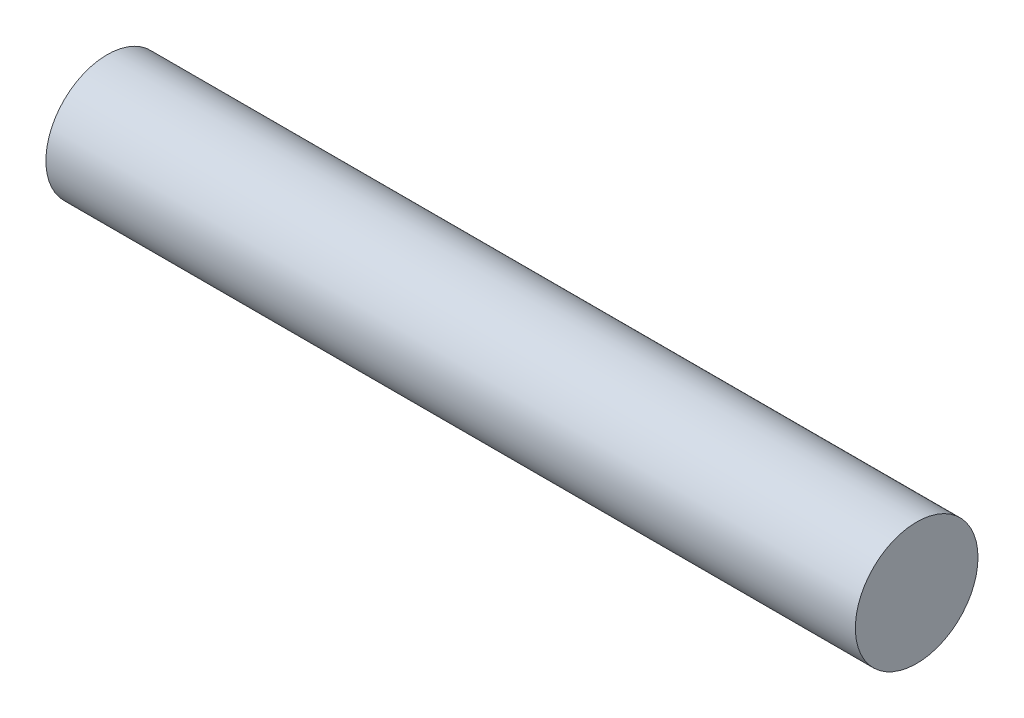
ISO-10303-21;
HEADER;
FILE_DESCRIPTION(('STEP AP214'),'2;1');
FILE_NAME('part.step','',(''),(''),'','','');
FILE_SCHEMA(('AUTOMOTIVE_DESIGN { 1 0 10303 214 1 1 1 1 }'));
ENDSEC;
DATA;
#1=APPLICATION_CONTEXT('core data for automotive mechanical design processes');
#2=APPLICATION_PROTOCOL_DEFINITION('international standard','automotive_design',2000,#1);
#3=PRODUCT_CONTEXT('',#1,'mechanical');
#4=PRODUCT('Part','Part','',(#3));
#5=PRODUCT_RELATED_PRODUCT_CATEGORY('part','',(#4));
#6=PRODUCT_DEFINITION_FORMATION('','',#4);
#7=PRODUCT_DEFINITION_CONTEXT('part definition',#1,'design');
#8=PRODUCT_DEFINITION('design','',#6,#7);
#9=PRODUCT_DEFINITION_SHAPE('','',#8);
#10=(LENGTH_UNIT() NAMED_UNIT(*) SI_UNIT(.MILLI.,.METRE.));
#11=(NAMED_UNIT(*) PLANE_ANGLE_UNIT() SI_UNIT($,.RADIAN.));
#12=(NAMED_UNIT(*) SI_UNIT($,.STERADIAN.) SOLID_ANGLE_UNIT());
#13=UNCERTAINTY_MEASURE_WITH_UNIT(LENGTH_MEASURE(1.E-05),#10,'distance_accuracy_value','');
#14=(GEOMETRIC_REPRESENTATION_CONTEXT(3) GLOBAL_UNCERTAINTY_ASSIGNED_CONTEXT((#13)) GLOBAL_UNIT_ASSIGNED_CONTEXT((#10,
#11,#12)) REPRESENTATION_CONTEXT('',''));
#15=CARTESIAN_POINT('',(0.,0.,0.));
#16=DIRECTION('',(0.,0.,1.));
#17=DIRECTION('',(1.,0.,0.));
#18=AXIS2_PLACEMENT_3D('',#15,#16,#17);
#19=CARTESIAN_POINT('',(41.91,0.,0.));
#20=DIRECTION('',(-1.,0.,0.));
#21=DIRECTION('',(0.,0.,1.));
#22=AXIS2_PLACEMENT_3D('',#19,#20,#21);
#23=CYLINDRICAL_SURFACE('',#22,3.175);
#24=CARTESIAN_POINT('',(41.91,0.,0.));
#25=DIRECTION('',(1.,0.,0.));
#26=DIRECTION('',(0.,0.,-1.));
#27=AXIS2_PLACEMENT_3D('',#24,#25,#26);
#28=CIRCLE('',#27,3.175);
#29=CARTESIAN_POINT('',(41.91,0.,-3.175));
#30=VERTEX_POINT('',#29);
#31=EDGE_CURVE('E10',#30,#30,#28,.T.);
#32=ORIENTED_EDGE('',*,*,#31,.F.);
#33=EDGE_LOOP('',(#32));
#34=FACE_BOUND('',#33,.T.);
#35=CARTESIAN_POINT('',(0.,0.,0.));
#36=DIRECTION('',(1.,0.,0.));
#37=DIRECTION('',(0.,0.,-1.));
#38=AXIS2_PLACEMENT_3D('',#35,#36,#37);
#39=CIRCLE('',#38,3.175);
#40=CARTESIAN_POINT('',(0.,0.,-3.175));
#41=VERTEX_POINT('',#40);
#42=EDGE_CURVE('E38',#41,#41,#39,.T.);
#43=ORIENTED_EDGE('',*,*,#42,.T.);
#44=EDGE_LOOP('',(#43));
#45=FACE_BOUND('',#44,.T.);
#46=ADVANCED_FACE('F35',(#34,#45),#23,.T.);
#47=CARTESIAN_POINT('',(41.91,0.,0.));
#48=DIRECTION('',(1.,0.,0.));
#49=DIRECTION('',(0.,0.,-1.));
#50=AXIS2_PLACEMENT_3D('',#47,#48,#49);
#51=PLANE('',#50);
#52=ORIENTED_EDGE('',*,*,#31,.T.);
#53=EDGE_LOOP('',(#52));
#54=FACE_BOUND('',#53,.T.);
#55=ADVANCED_FACE('F50',(#54),#51,.T.);
#56=CARTESIAN_POINT('',(0.,0.,0.));
#57=DIRECTION('',(1.,0.,0.));
#58=DIRECTION('',(0.,0.,-1.));
#59=AXIS2_PLACEMENT_3D('',#56,#57,#58);
#60=PLANE('',#59);
#61=ORIENTED_EDGE('',*,*,#42,.F.);
#62=EDGE_LOOP('',(#61));
#63=FACE_BOUND('',#62,.T.);
#64=ADVANCED_FACE('F48',(#63),#60,.F.);
#65=CLOSED_SHELL('',(#46,#55,#64));
#66=MANIFOLD_SOLID_BREP('B2',#65);
#67=ADVANCED_BREP_SHAPE_REPRESENTATION('',(#18,#66),#14);
#68=SHAPE_DEFINITION_REPRESENTATION(#9,#67);
ENDSEC;
END-ISO-10303-21;
